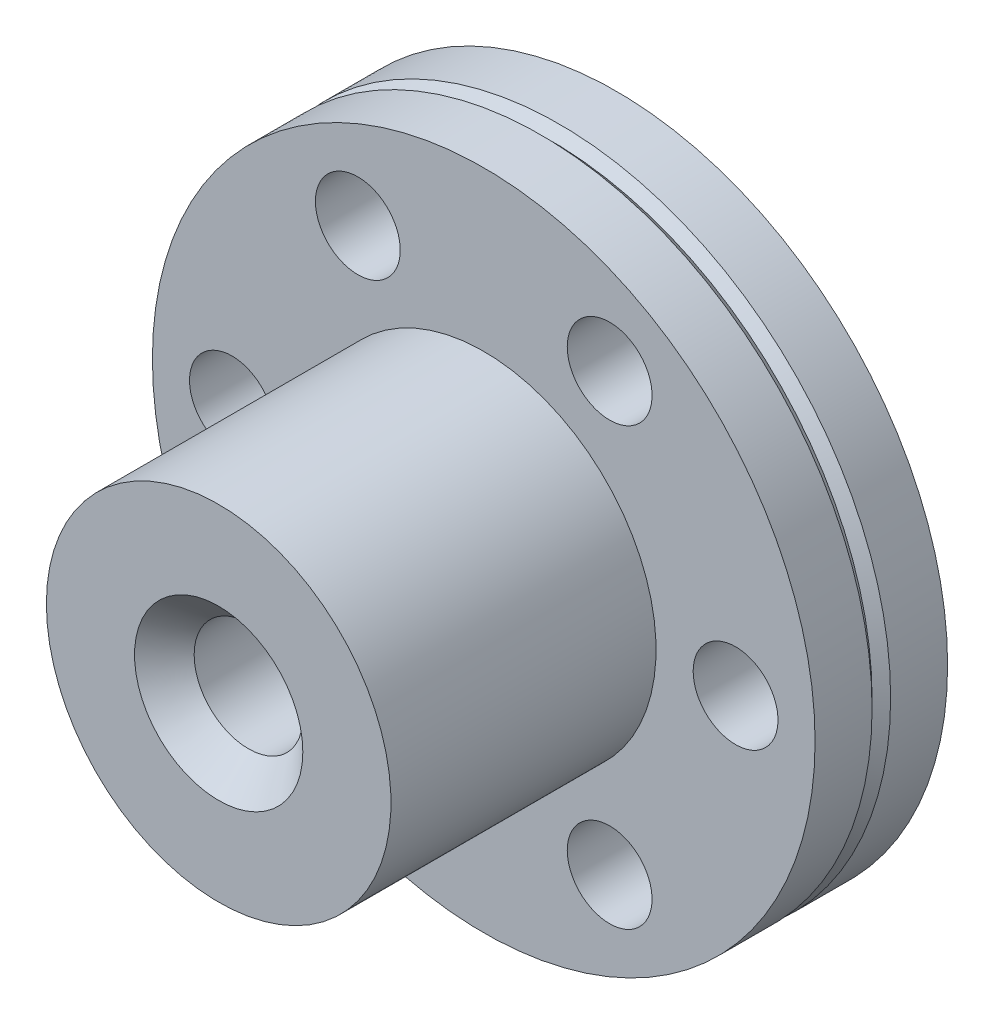
ISO-10303-21;
HEADER;
FILE_DESCRIPTION(('STEP AP214'),'2;1');
FILE_NAME('part.step','',(''),(''),'','','');
FILE_SCHEMA(('AUTOMOTIVE_DESIGN { 1 0 10303 214 1 1 1 1 }'));
ENDSEC;
DATA;
#1=APPLICATION_CONTEXT('core data for automotive mechanical design processes');
#2=APPLICATION_PROTOCOL_DEFINITION('international standard','automotive_design',2000,#1);
#3=PRODUCT_CONTEXT('',#1,'mechanical');
#4=PRODUCT('Part','Part','',(#3));
#5=PRODUCT_RELATED_PRODUCT_CATEGORY('part','',(#4));
#6=PRODUCT_DEFINITION_FORMATION('','',#4);
#7=PRODUCT_DEFINITION_CONTEXT('part definition',#1,'design');
#8=PRODUCT_DEFINITION('design','',#6,#7);
#9=PRODUCT_DEFINITION_SHAPE('','',#8);
#10=(LENGTH_UNIT() NAMED_UNIT(*) SI_UNIT(.MILLI.,.METRE.));
#11=(NAMED_UNIT(*) PLANE_ANGLE_UNIT() SI_UNIT($,.RADIAN.));
#12=(NAMED_UNIT(*) SI_UNIT($,.STERADIAN.) SOLID_ANGLE_UNIT());
#13=UNCERTAINTY_MEASURE_WITH_UNIT(LENGTH_MEASURE(1.E-05),#10,'distance_accuracy_value','');
#14=(GEOMETRIC_REPRESENTATION_CONTEXT(3) GLOBAL_UNCERTAINTY_ASSIGNED_CONTEXT((#13)) GLOBAL_UNIT_ASSIGNED_CONTEXT((#10,
#11,#12)) REPRESENTATION_CONTEXT('',''));
#15=CARTESIAN_POINT('',(0.,0.,0.));
#16=DIRECTION('',(0.,0.,1.));
#17=DIRECTION('',(1.,0.,0.));
#18=AXIS2_PLACEMENT_3D('',#15,#16,#17);
#19=CARTESIAN_POINT('',(4.8375,0.,15.));
#20=DIRECTION('',(0.,0.,1.));
#21=DIRECTION('',(1.,0.,0.));
#22=AXIS2_PLACEMENT_3D('',#19,#20,#21);
#23=PLANE('',#22);
#24=CARTESIAN_POINT('',(0.,0.,14.9999999999864));
#25=DIRECTION('',(0.,0.,1.));
#26=DIRECTION('',(1.,0.,0.));
#27=AXIS2_PLACEMENT_3D('',#24,#25,#26);
#28=CIRCLE('',#27,3.17499999999882);
#29=CARTESIAN_POINT('',(3.17499999999882,0.,14.9999999999864));
#30=VERTEX_POINT('',#29);
#31=EDGE_CURVE('E93',#30,#30,#28,.F.);
#32=ORIENTED_EDGE('',*,*,#31,.T.);
#33=EDGE_LOOP('',(#32));
#34=FACE_BOUND('',#33,.T.);
#35=CARTESIAN_POINT('',(0.,0.,15.));
#36=DIRECTION('',(0.,0.,-1.));
#37=DIRECTION('',(-1.,0.,0.));
#38=AXIS2_PLACEMENT_3D('',#35,#36,#37);
#39=CIRCLE('',#38,6.5);
#40=CARTESIAN_POINT('',(-6.5,0.,15.));
#41=VERTEX_POINT('',#40);
#42=EDGE_CURVE('E17',#41,#41,#39,.T.);
#43=ORIENTED_EDGE('',*,*,#42,.F.);
#44=EDGE_LOOP('',(#43));
#45=FACE_BOUND('',#44,.T.);
#46=ADVANCED_FACE('F14',(#34,#45),#23,.T.);
#47=CARTESIAN_POINT('',(0.,0.,3.925));
#48=DIRECTION('',(0.,0.,-1.));
#49=DIRECTION('',(-1.,0.,0.));
#50=AXIS2_PLACEMENT_3D('',#47,#48,#49);
#51=CYLINDRICAL_SURFACE('',#50,12.5);
#52=CARTESIAN_POINT('',(0.,0.,2.85));
#53=DIRECTION('',(0.,0.,1.));
#54=DIRECTION('',(1.,0.,0.));
#55=AXIS2_PLACEMENT_3D('',#52,#53,#54);
#56=CIRCLE('',#55,12.5);
#57=CARTESIAN_POINT('',(12.5,0.,2.85));
#58=VERTEX_POINT('',#57);
#59=EDGE_CURVE('E32',#58,#58,#56,.F.);
#60=ORIENTED_EDGE('',*,*,#59,.F.);
#61=EDGE_LOOP('',(#60));
#62=FACE_BOUND('',#61,.T.);
#63=CARTESIAN_POINT('',(0.,0.,5.));
#64=DIRECTION('',(0.,0.,-1.));
#65=DIRECTION('',(-1.,0.,0.));
#66=AXIS2_PLACEMENT_3D('',#63,#64,#65);
#67=CIRCLE('',#66,12.5);
#68=CARTESIAN_POINT('',(-12.5,0.,5.));
#69=VERTEX_POINT('',#68);
#70=EDGE_CURVE('E90',#69,#69,#67,.F.);
#71=ORIENTED_EDGE('',*,*,#70,.F.);
#72=EDGE_LOOP('',(#71));
#73=FACE_BOUND('',#72,.T.);
#74=ADVANCED_FACE('F107',(#62,#73),#51,.T.);
#75=CARTESIAN_POINT('',(0.,0.,10.));
#76=DIRECTION('',(0.,0.,-1.));
#77=DIRECTION('',(-1.,0.,0.));
#78=AXIS2_PLACEMENT_3D('',#75,#76,#77);
#79=CYLINDRICAL_SURFACE('',#78,6.5);
#80=CARTESIAN_POINT('',(0.,0.,5.));
#81=DIRECTION('',(0.,0.,-1.));
#82=DIRECTION('',(-1.,0.,0.));
#83=AXIS2_PLACEMENT_3D('',#80,#81,#82);
#84=CIRCLE('',#83,6.5);
#85=CARTESIAN_POINT('',(-6.5,0.,5.));
#86=VERTEX_POINT('',#85);
#87=EDGE_CURVE('E85',#86,#86,#84,.T.);
#88=ORIENTED_EDGE('',*,*,#87,.F.);
#89=EDGE_LOOP('',(#88));
#90=FACE_BOUND('',#89,.T.);
#91=ORIENTED_EDGE('',*,*,#42,.T.);
#92=EDGE_LOOP('',(#91));
#93=FACE_BOUND('',#92,.T.);
#94=ADVANCED_FACE('F104',(#90,#93),#79,.T.);
#95=CARTESIAN_POINT('',(0.,0.,14.9999999999864));
#96=DIRECTION('',(0.,0.,1.));
#97=DIRECTION('',(1.,0.,0.));
#98=AXIS2_PLACEMENT_3D('',#95,#96,#97);
#99=CONICAL_SURFACE('',#98,3.17499999999882,0.785398163397448);
#100=ORIENTED_EDGE('',*,*,#31,.F.);
#101=EDGE_LOOP('',(#100));
#102=FACE_BOUND('',#101,.T.);
#103=CARTESIAN_POINT('',(0.,0.,13.875));
#104=DIRECTION('',(0.,0.,-1.));
#105=DIRECTION('',(-1.,0.,0.));
#106=AXIS2_PLACEMENT_3D('',#103,#104,#105);
#107=CIRCLE('',#106,2.05);
#108=CARTESIAN_POINT('',(-2.05,0.,13.875));
#109=VERTEX_POINT('',#108);
#110=EDGE_CURVE('E89',#109,#109,#107,.T.);
#111=ORIENTED_EDGE('',*,*,#110,.T.);
#112=EDGE_LOOP('',(#111));
#113=FACE_BOUND('',#112,.T.);
#114=ADVANCED_FACE('F165',(#102,#113),#99,.F.);
#115=CARTESIAN_POINT('',(0.,0.,2.85));
#116=DIRECTION('',(0.,0.,1.));
#117=DIRECTION('',(1.,0.,0.));
#118=AXIS2_PLACEMENT_3D('',#115,#116,#117);
#119=CONICAL_SURFACE('',#118,12.5,0.785398163397448);
#120=CARTESIAN_POINT('',(0.,0.,2.5));
#121=DIRECTION('',(0.,0.,-1.));
#122=DIRECTION('',(1.,0.,0.));
#123=AXIS2_PLACEMENT_3D('',#120,#121,#122);
#124=CIRCLE('',#123,12.15);
#125=CARTESIAN_POINT('',(12.15,0.,2.5));
#126=VERTEX_POINT('',#125);
#127=EDGE_CURVE('E84',#126,#126,#124,.T.);
#128=ORIENTED_EDGE('',*,*,#127,.F.);
#129=EDGE_LOOP('',(#128));
#130=FACE_BOUND('',#129,.T.);
#131=ORIENTED_EDGE('',*,*,#59,.T.);
#132=EDGE_LOOP('',(#131));
#133=FACE_BOUND('',#132,.T.);
#134=ADVANCED_FACE('F161',(#130,#133),#119,.T.);
#135=CARTESIAN_POINT('',(9.5,0.,5.));
#136=DIRECTION('',(0.,0.,1.));
#137=DIRECTION('',(1.,0.,0.));
#138=AXIS2_PLACEMENT_3D('',#135,#136,#137);
#139=PLANE('',#138);
#140=ORIENTED_EDGE('',*,*,#87,.T.);
#141=EDGE_LOOP('',(#140));
#142=FACE_BOUND('',#141,.T.);
#143=ORIENTED_EDGE('',*,*,#70,.T.);
#144=EDGE_LOOP('',(#143));
#145=FACE_BOUND('',#144,.T.);
#146=CARTESIAN_POINT('',(9.5,0.,5.));
#147=DIRECTION('',(0.,0.,-1.));
#148=DIRECTION('',(-1.,0.,0.));
#149=AXIS2_PLACEMENT_3D('',#146,#147,#148);
#150=CIRCLE('',#149,1.6);
#151=CARTESIAN_POINT('',(7.9,0.,5.));
#152=VERTEX_POINT('',#151);
#153=EDGE_CURVE('E59',#152,#152,#150,.T.);
#154=ORIENTED_EDGE('',*,*,#153,.T.);
#155=EDGE_LOOP('',(#154));
#156=FACE_BOUND('',#155,.T.);
#157=CARTESIAN_POINT('',(4.75,8.227241336,5.));
#158=DIRECTION('',(0.,0.,-1.));
#159=DIRECTION('',(-1.,0.,0.));
#160=AXIS2_PLACEMENT_3D('',#157,#158,#159);
#161=CIRCLE('',#160,1.6);
#162=CARTESIAN_POINT('',(3.15,8.227241336,5.));
#163=VERTEX_POINT('',#162);
#164=EDGE_CURVE('E64',#163,#163,#161,.T.);
#165=ORIENTED_EDGE('',*,*,#164,.T.);
#166=EDGE_LOOP('',(#165));
#167=FACE_BOUND('',#166,.T.);
#168=CARTESIAN_POINT('',(-4.75,8.227241336,5.));
#169=DIRECTION('',(0.,0.,-1.));
#170=DIRECTION('',(-1.,0.,0.));
#171=AXIS2_PLACEMENT_3D('',#168,#169,#170);
#172=CIRCLE('',#171,1.6);
#173=CARTESIAN_POINT('',(-6.35,8.227241336,5.));
#174=VERTEX_POINT('',#173);
#175=EDGE_CURVE('E68',#174,#174,#172,.T.);
#176=ORIENTED_EDGE('',*,*,#175,.T.);
#177=EDGE_LOOP('',(#176));
#178=FACE_BOUND('',#177,.T.);
#179=CARTESIAN_POINT('',(-9.5,0.,5.));
#180=DIRECTION('',(0.,0.,-1.));
#181=DIRECTION('',(-1.,0.,0.));
#182=AXIS2_PLACEMENT_3D('',#179,#180,#181);
#183=CIRCLE('',#182,1.6);
#184=CARTESIAN_POINT('',(-11.1,0.,5.));
#185=VERTEX_POINT('',#184);
#186=EDGE_CURVE('E72',#185,#185,#183,.T.);
#187=ORIENTED_EDGE('',*,*,#186,.T.);
#188=EDGE_LOOP('',(#187));
#189=FACE_BOUND('',#188,.T.);
#190=CARTESIAN_POINT('',(-4.75,-8.227241336,5.));
#191=DIRECTION('',(0.,0.,-1.));
#192=DIRECTION('',(-1.,0.,0.));
#193=AXIS2_PLACEMENT_3D('',#190,#191,#192);
#194=CIRCLE('',#193,1.6);
#195=CARTESIAN_POINT('',(-6.35,-8.227241336,5.));
#196=VERTEX_POINT('',#195);
#197=EDGE_CURVE('E76',#196,#196,#194,.T.);
#198=ORIENTED_EDGE('',*,*,#197,.T.);
#199=EDGE_LOOP('',(#198));
#200=FACE_BOUND('',#199,.T.);
#201=CARTESIAN_POINT('',(4.75,-8.227241336,5.));
#202=DIRECTION('',(0.,0.,-1.));
#203=DIRECTION('',(-1.,0.,0.));
#204=AXIS2_PLACEMENT_3D('',#201,#202,#203);
#205=CIRCLE('',#204,1.6);
#206=CARTESIAN_POINT('',(3.15,-8.227241336,5.));
#207=VERTEX_POINT('',#206);
#208=EDGE_CURVE('E80',#207,#207,#205,.T.);
#209=ORIENTED_EDGE('',*,*,#208,.T.);
#210=EDGE_LOOP('',(#209));
#211=FACE_BOUND('',#210,.T.);
#212=ADVANCED_FACE('F157',(#142,#145,#156,#167,#178,#189,#200,#211),#139,.T.);
#213=CARTESIAN_POINT('',(0.,0.,7.5));
#214=DIRECTION('',(0.,0.,-1.));
#215=DIRECTION('',(-1.,0.,0.));
#216=AXIS2_PLACEMENT_3D('',#213,#214,#215);
#217=CYLINDRICAL_SURFACE('',#216,2.05);
#218=ORIENTED_EDGE('',*,*,#110,.F.);
#219=EDGE_LOOP('',(#218));
#220=FACE_BOUND('',#219,.T.);
#221=CARTESIAN_POINT('',(0.,0.,1.12500000000182));
#222=DIRECTION('',(0.,0.,-1.));
#223=DIRECTION('',(1.,0.,0.));
#224=AXIS2_PLACEMENT_3D('',#221,#222,#223);
#225=CIRCLE('',#224,2.049999999997);
#226=CARTESIAN_POINT('',(2.049999999997,0.,1.12500000000182));
#227=VERTEX_POINT('',#226);
#228=EDGE_CURVE('E63',#227,#227,#225,.T.);
#229=ORIENTED_EDGE('',*,*,#228,.T.);
#230=EDGE_LOOP('',(#229));
#231=FACE_BOUND('',#230,.T.);
#232=ADVANCED_FACE('F153',(#220,#231),#217,.F.);
#233=CARTESIAN_POINT('',(0.,0.,2.15));
#234=DIRECTION('',(0.,0.,-1.));
#235=DIRECTION('',(-1.,0.,0.));
#236=AXIS2_PLACEMENT_3D('',#233,#234,#235);
#237=CONICAL_SURFACE('',#236,12.5,0.785398163397448);
#238=CARTESIAN_POINT('',(0.,0.,2.15));
#239=DIRECTION('',(0.,0.,-1.));
#240=DIRECTION('',(-1.,0.,0.));
#241=AXIS2_PLACEMENT_3D('',#238,#239,#240);
#242=CIRCLE('',#241,12.5);
#243=CARTESIAN_POINT('',(-12.5,0.,2.15));
#244=VERTEX_POINT('',#243);
#245=EDGE_CURVE('E58',#244,#244,#242,.T.);
#246=ORIENTED_EDGE('',*,*,#245,.F.);
#247=EDGE_LOOP('',(#246));
#248=FACE_BOUND('',#247,.T.);
#249=ORIENTED_EDGE('',*,*,#127,.T.);
#250=EDGE_LOOP('',(#249));
#251=FACE_BOUND('',#250,.T.);
#252=ADVANCED_FACE('F149',(#248,#251),#237,.T.);
#253=CARTESIAN_POINT('',(4.75,-8.227241336,2.5));
#254=DIRECTION('',(0.,0.,-1.));
#255=DIRECTION('',(-1.,0.,0.));
#256=AXIS2_PLACEMENT_3D('',#253,#254,#255);
#257=CYLINDRICAL_SURFACE('',#256,1.6);
#258=CARTESIAN_POINT('',(4.75,-8.227241336,0.));
#259=DIRECTION('',(0.,0.,-1.));
#260=DIRECTION('',(-1.,0.,0.));
#261=AXIS2_PLACEMENT_3D('',#258,#259,#260);
#262=CIRCLE('',#261,1.6);
#263=CARTESIAN_POINT('',(3.15,-8.227241336,0.));
#264=VERTEX_POINT('',#263);
#265=EDGE_CURVE('E54',#264,#264,#262,.F.);
#266=ORIENTED_EDGE('',*,*,#265,.F.);
#267=EDGE_LOOP('',(#266));
#268=FACE_BOUND('',#267,.T.);
#269=ORIENTED_EDGE('',*,*,#208,.F.);
#270=EDGE_LOOP('',(#269));
#271=FACE_BOUND('',#270,.T.);
#272=ADVANCED_FACE('F145',(#268,#271),#257,.F.);
#273=CARTESIAN_POINT('',(-4.75,-8.227241336,2.5));
#274=DIRECTION('',(0.,0.,-1.));
#275=DIRECTION('',(-1.,0.,0.));
#276=AXIS2_PLACEMENT_3D('',#273,#274,#275);
#277=CYLINDRICAL_SURFACE('',#276,1.6);
#278=CARTESIAN_POINT('',(-4.75,-8.227241336,0.));
#279=DIRECTION('',(0.,0.,-1.));
#280=DIRECTION('',(-1.,0.,0.));
#281=AXIS2_PLACEMENT_3D('',#278,#279,#280);
#282=CIRCLE('',#281,1.6);
#283=CARTESIAN_POINT('',(-6.35,-8.227241336,0.));
#284=VERTEX_POINT('',#283);
#285=EDGE_CURVE('E50',#284,#284,#282,.F.);
#286=ORIENTED_EDGE('',*,*,#285,.F.);
#287=EDGE_LOOP('',(#286));
#288=FACE_BOUND('',#287,.T.);
#289=ORIENTED_EDGE('',*,*,#197,.F.);
#290=EDGE_LOOP('',(#289));
#291=FACE_BOUND('',#290,.T.);
#292=ADVANCED_FACE('F141',(#288,#291),#277,.F.);
#293=CARTESIAN_POINT('',(-9.5,0.,2.5));
#294=DIRECTION('',(0.,0.,-1.));
#295=DIRECTION('',(-1.,0.,0.));
#296=AXIS2_PLACEMENT_3D('',#293,#294,#295);
#297=CYLINDRICAL_SURFACE('',#296,1.6);
#298=CARTESIAN_POINT('',(-9.5,0.,0.));
#299=DIRECTION('',(0.,0.,-1.));
#300=DIRECTION('',(-1.,0.,0.));
#301=AXIS2_PLACEMENT_3D('',#298,#299,#300);
#302=CIRCLE('',#301,1.6);
#303=CARTESIAN_POINT('',(-11.1,0.,0.));
#304=VERTEX_POINT('',#303);
#305=EDGE_CURVE('E46',#304,#304,#302,.F.);
#306=ORIENTED_EDGE('',*,*,#305,.F.);
#307=EDGE_LOOP('',(#306));
#308=FACE_BOUND('',#307,.T.);
#309=ORIENTED_EDGE('',*,*,#186,.F.);
#310=EDGE_LOOP('',(#309));
#311=FACE_BOUND('',#310,.T.);
#312=ADVANCED_FACE('F137',(#308,#311),#297,.F.);
#313=CARTESIAN_POINT('',(-4.75,8.227241336,2.5));
#314=DIRECTION('',(0.,0.,-1.));
#315=DIRECTION('',(-1.,0.,0.));
#316=AXIS2_PLACEMENT_3D('',#313,#314,#315);
#317=CYLINDRICAL_SURFACE('',#316,1.6);
#318=CARTESIAN_POINT('',(-4.75,8.227241336,0.));
#319=DIRECTION('',(0.,0.,-1.));
#320=DIRECTION('',(-1.,0.,0.));
#321=AXIS2_PLACEMENT_3D('',#318,#319,#320);
#322=CIRCLE('',#321,1.6);
#323=CARTESIAN_POINT('',(-6.35,8.227241336,0.));
#324=VERTEX_POINT('',#323);
#325=EDGE_CURVE('E42',#324,#324,#322,.F.);
#326=ORIENTED_EDGE('',*,*,#325,.F.);
#327=EDGE_LOOP('',(#326));
#328=FACE_BOUND('',#327,.T.);
#329=ORIENTED_EDGE('',*,*,#175,.F.);
#330=EDGE_LOOP('',(#329));
#331=FACE_BOUND('',#330,.T.);
#332=ADVANCED_FACE('F133',(#328,#331),#317,.F.);
#333=CARTESIAN_POINT('',(4.75,8.227241336,2.5));
#334=DIRECTION('',(0.,0.,-1.));
#335=DIRECTION('',(-1.,0.,0.));
#336=AXIS2_PLACEMENT_3D('',#333,#334,#335);
#337=CYLINDRICAL_SURFACE('',#336,1.6);
#338=CARTESIAN_POINT('',(4.75,8.227241336,0.));
#339=DIRECTION('',(0.,0.,-1.));
#340=DIRECTION('',(-1.,0.,0.));
#341=AXIS2_PLACEMENT_3D('',#338,#339,#340);
#342=CIRCLE('',#341,1.6);
#343=CARTESIAN_POINT('',(3.15,8.227241336,0.));
#344=VERTEX_POINT('',#343);
#345=EDGE_CURVE('E38',#344,#344,#342,.F.);
#346=ORIENTED_EDGE('',*,*,#345,.F.);
#347=EDGE_LOOP('',(#346));
#348=FACE_BOUND('',#347,.T.);
#349=ORIENTED_EDGE('',*,*,#164,.F.);
#350=EDGE_LOOP('',(#349));
#351=FACE_BOUND('',#350,.T.);
#352=ADVANCED_FACE('F129',(#348,#351),#337,.F.);
#353=CARTESIAN_POINT('',(9.5,0.,2.5));
#354=DIRECTION('',(0.,0.,-1.));
#355=DIRECTION('',(-1.,0.,0.));
#356=AXIS2_PLACEMENT_3D('',#353,#354,#355);
#357=CYLINDRICAL_SURFACE('',#356,1.6);
#358=CARTESIAN_POINT('',(9.5,0.,0.));
#359=DIRECTION('',(0.,0.,-1.));
#360=DIRECTION('',(-1.,0.,0.));
#361=AXIS2_PLACEMENT_3D('',#358,#359,#360);
#362=CIRCLE('',#361,1.6);
#363=CARTESIAN_POINT('',(7.9,0.,0.));
#364=VERTEX_POINT('',#363);
#365=EDGE_CURVE('E29',#364,#364,#362,.F.);
#366=ORIENTED_EDGE('',*,*,#365,.F.);
#367=EDGE_LOOP('',(#366));
#368=FACE_BOUND('',#367,.T.);
#369=ORIENTED_EDGE('',*,*,#153,.F.);
#370=EDGE_LOOP('',(#369));
#371=FACE_BOUND('',#370,.T.);
#372=ADVANCED_FACE('F125',(#368,#371),#357,.F.);
#373=CARTESIAN_POINT('',(0.,0.,-5.6843418860808E-11));
#374=DIRECTION('',(0.,0.,-1.));
#375=DIRECTION('',(-1.,0.,0.));
#376=AXIS2_PLACEMENT_3D('',#373,#374,#375);
#377=CONICAL_SURFACE('',#376,3.17499999999882,0.785398163372185);
#378=ORIENTED_EDGE('',*,*,#228,.F.);
#379=EDGE_LOOP('',(#378));
#380=FACE_BOUND('',#379,.T.);
#381=CARTESIAN_POINT('',(0.,0.,-5.6843418860808E-11));
#382=DIRECTION('',(0.,0.,-1.));
#383=DIRECTION('',(-1.,0.,0.));
#384=AXIS2_PLACEMENT_3D('',#381,#382,#383);
#385=CIRCLE('',#384,3.17499999999882);
#386=CARTESIAN_POINT('',(-3.17499999999882,0.,-5.6843418860808E-11));
#387=VERTEX_POINT('',#386);
#388=EDGE_CURVE('E22',#387,#387,#385,.F.);
#389=ORIENTED_EDGE('',*,*,#388,.F.);
#390=EDGE_LOOP('',(#389));
#391=FACE_BOUND('',#390,.T.);
#392=ADVANCED_FACE('F118',(#380,#391),#377,.F.);
#393=CARTESIAN_POINT('',(0.,0.,1.075));
#394=DIRECTION('',(0.,0.,-1.));
#395=DIRECTION('',(-1.,0.,0.));
#396=AXIS2_PLACEMENT_3D('',#393,#394,#395);
#397=CYLINDRICAL_SURFACE('',#396,12.5);
#398=CARTESIAN_POINT('',(0.,0.,0.));
#399=DIRECTION('',(0.,0.,-1.));
#400=DIRECTION('',(-1.,0.,0.));
#401=AXIS2_PLACEMENT_3D('',#398,#399,#400);
#402=CIRCLE('',#401,12.5);
#403=CARTESIAN_POINT('',(-12.5,0.,0.));
#404=VERTEX_POINT('',#403);
#405=EDGE_CURVE('E10',#404,#404,#402,.T.);
#406=ORIENTED_EDGE('',*,*,#405,.F.);
#407=EDGE_LOOP('',(#406));
#408=FACE_BOUND('',#407,.T.);
#409=ORIENTED_EDGE('',*,*,#245,.T.);
#410=EDGE_LOOP('',(#409));
#411=FACE_BOUND('',#410,.T.);
#412=ADVANCED_FACE('F114',(#408,#411),#397,.T.);
#413=CARTESIAN_POINT('',(7.8375,0.,0.));
#414=DIRECTION('',(0.,0.,-1.));
#415=DIRECTION('',(-1.,0.,0.));
#416=AXIS2_PLACEMENT_3D('',#413,#414,#415);
#417=PLANE('',#416);
#418=ORIENTED_EDGE('',*,*,#405,.T.);
#419=EDGE_LOOP('',(#418));
#420=FACE_BOUND('',#419,.T.);
#421=ORIENTED_EDGE('',*,*,#388,.T.);
#422=EDGE_LOOP('',(#421));
#423=FACE_BOUND('',#422,.T.);
#424=ORIENTED_EDGE('',*,*,#365,.T.);
#425=EDGE_LOOP('',(#424));
#426=FACE_BOUND('',#425,.T.);
#427=ORIENTED_EDGE('',*,*,#345,.T.);
#428=EDGE_LOOP('',(#427));
#429=FACE_BOUND('',#428,.T.);
#430=ORIENTED_EDGE('',*,*,#325,.T.);
#431=EDGE_LOOP('',(#430));
#432=FACE_BOUND('',#431,.T.);
#433=ORIENTED_EDGE('',*,*,#305,.T.);
#434=EDGE_LOOP('',(#433));
#435=FACE_BOUND('',#434,.T.);
#436=ORIENTED_EDGE('',*,*,#285,.T.);
#437=EDGE_LOOP('',(#436));
#438=FACE_BOUND('',#437,.T.);
#439=ORIENTED_EDGE('',*,*,#265,.T.);
#440=EDGE_LOOP('',(#439));
#441=FACE_BOUND('',#440,.T.);
#442=ADVANCED_FACE('F112',(#420,#423,#426,#429,#432,#435,#438,#441),#417,.T.);
#443=CLOSED_SHELL('',(#46,#74,#94,#114,#134,#212,#232,#252,#272,#292,#312,#332,#352,#372,#392,
#412,#442));
#444=MANIFOLD_SOLID_BREP('B1',#443);
#445=ADVANCED_BREP_SHAPE_REPRESENTATION('',(#18,#444),#14);
#446=SHAPE_DEFINITION_REPRESENTATION(#9,#445);
ENDSEC;
END-ISO-10303-21;
